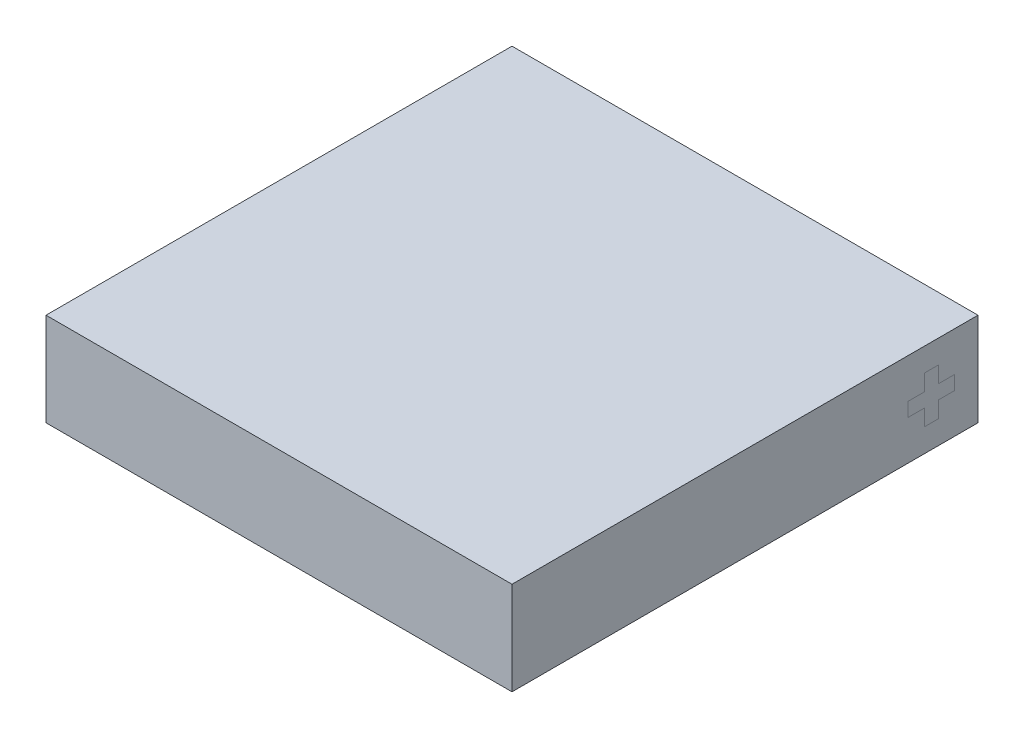
ISO-10303-21;
HEADER;
FILE_DESCRIPTION(('STEP AP214'),'2;1');
FILE_NAME('part.step','',(''),(''),'','','');
FILE_SCHEMA(('AUTOMOTIVE_DESIGN { 1 0 10303 214 1 1 1 1 }'));
ENDSEC;
DATA;
#1=APPLICATION_CONTEXT('core data for automotive mechanical design processes');
#2=APPLICATION_PROTOCOL_DEFINITION('international standard','automotive_design',2000,#1);
#3=PRODUCT_CONTEXT('',#1,'mechanical');
#4=PRODUCT('Part','Part','',(#3));
#5=PRODUCT_RELATED_PRODUCT_CATEGORY('part','',(#4));
#6=PRODUCT_DEFINITION_FORMATION('','',#4);
#7=PRODUCT_DEFINITION_CONTEXT('part definition',#1,'design');
#8=PRODUCT_DEFINITION('design','',#6,#7);
#9=PRODUCT_DEFINITION_SHAPE('','',#8);
#10=(LENGTH_UNIT() NAMED_UNIT(*) SI_UNIT(.MILLI.,.METRE.));
#11=(NAMED_UNIT(*) PLANE_ANGLE_UNIT() SI_UNIT($,.RADIAN.));
#12=(NAMED_UNIT(*) SI_UNIT($,.STERADIAN.) SOLID_ANGLE_UNIT());
#13=UNCERTAINTY_MEASURE_WITH_UNIT(LENGTH_MEASURE(1.E-05),#10,'distance_accuracy_value','');
#14=(GEOMETRIC_REPRESENTATION_CONTEXT(3) GLOBAL_UNCERTAINTY_ASSIGNED_CONTEXT((#13)) GLOBAL_UNIT_ASSIGNED_CONTEXT((#10,
#11,#12)) REPRESENTATION_CONTEXT('',''));
#15=CARTESIAN_POINT('',(0.,0.,0.));
#16=DIRECTION('',(0.,0.,1.));
#17=DIRECTION('',(1.,0.,0.));
#18=AXIS2_PLACEMENT_3D('',#15,#16,#17);
#19=CARTESIAN_POINT('',(5.,2.,-5.));
#20=DIRECTION('',(-1.,0.,0.));
#21=DIRECTION('',(0.,0.,1.));
#22=AXIS2_PLACEMENT_3D('',#19,#20,#21);
#23=PLANE('',#22);
#24=DIRECTION('',(0.,1.,0.));
#25=VECTOR('',#24,1.);
#26=CARTESIAN_POINT('',(5.,0.850000000000001,-4.15));
#27=LINE('',#26,#25);
#28=CARTESIAN_POINT('',(5.,0.500000000000001,-4.15));
#29=VERTEX_POINT('',#28);
#30=CARTESIAN_POINT('',(5.,0.850000000000001,-4.15));
#31=VERTEX_POINT('',#30);
#32=EDGE_CURVE('E445',#29,#31,#27,.T.);
#33=ORIENTED_EDGE('',*,*,#32,.T.);
#34=DIRECTION('',(0.,0.,-1.));
#35=VECTOR('',#34,1.);
#36=CARTESIAN_POINT('',(5.,0.850000000000001,-4.15));
#37=LINE('',#36,#35);
#38=CARTESIAN_POINT('',(5.,0.850000000000001,-4.5));
#39=VERTEX_POINT('',#38);
#40=EDGE_CURVE('E13',#31,#39,#37,.T.);
#41=ORIENTED_EDGE('',*,*,#40,.T.);
#42=DIRECTION('',(0.,1.,0.));
#43=VECTOR('',#42,1.);
#44=CARTESIAN_POINT('',(5.,1.15,-4.5));
#45=LINE('',#44,#43);
#46=CARTESIAN_POINT('',(5.,1.15,-4.5));
#47=VERTEX_POINT('',#46);
#48=EDGE_CURVE('E357',#39,#47,#45,.T.);
#49=ORIENTED_EDGE('',*,*,#48,.T.);
#50=DIRECTION('',(0.,0.,1.));
#51=VECTOR('',#50,1.);
#52=CARTESIAN_POINT('',(5.,1.15,-4.15));
#53=LINE('',#52,#51);
#54=CARTESIAN_POINT('',(5.,1.15,-4.15));
#55=VERTEX_POINT('',#54);
#56=EDGE_CURVE('E477',#47,#55,#53,.T.);
#57=ORIENTED_EDGE('',*,*,#56,.T.);
#58=DIRECTION('',(0.,1.,0.));
#59=VECTOR('',#58,1.);
#60=CARTESIAN_POINT('',(5.,1.5,-4.15));
#61=LINE('',#60,#59);
#62=CARTESIAN_POINT('',(5.,1.5,-4.15));
#63=VERTEX_POINT('',#62);
#64=EDGE_CURVE('E474',#55,#63,#61,.T.);
#65=ORIENTED_EDGE('',*,*,#64,.T.);
#66=DIRECTION('',(0.,0.,1.));
#67=VECTOR('',#66,1.);
#68=CARTESIAN_POINT('',(5.,1.5,-3.85));
#69=LINE('',#68,#67);
#70=CARTESIAN_POINT('',(5.,1.5,-3.85));
#71=VERTEX_POINT('',#70);
#72=EDGE_CURVE('E471',#63,#71,#69,.T.);
#73=ORIENTED_EDGE('',*,*,#72,.T.);
#74=DIRECTION('',(0.,-1.,0.));
#75=VECTOR('',#74,1.);
#76=CARTESIAN_POINT('',(5.,1.5,-3.85));
#77=LINE('',#76,#75);
#78=CARTESIAN_POINT('',(5.,1.15,-3.85));
#79=VERTEX_POINT('',#78);
#80=EDGE_CURVE('E468',#71,#79,#77,.T.);
#81=ORIENTED_EDGE('',*,*,#80,.T.);
#82=DIRECTION('',(0.,0.,1.));
#83=VECTOR('',#82,1.);
#84=CARTESIAN_POINT('',(5.,1.15,-3.5));
#85=LINE('',#84,#83);
#86=CARTESIAN_POINT('',(5.,1.15,-3.5));
#87=VERTEX_POINT('',#86);
#88=EDGE_CURVE('E465',#79,#87,#85,.T.);
#89=ORIENTED_EDGE('',*,*,#88,.T.);
#90=DIRECTION('',(0.,-1.,0.));
#91=VECTOR('',#90,1.);
#92=CARTESIAN_POINT('',(5.,1.15,-3.5));
#93=LINE('',#92,#91);
#94=CARTESIAN_POINT('',(5.,0.850000000000001,-3.5));
#95=VERTEX_POINT('',#94);
#96=EDGE_CURVE('E462',#87,#95,#93,.T.);
#97=ORIENTED_EDGE('',*,*,#96,.T.);
#98=DIRECTION('',(0.,0.,-1.));
#99=VECTOR('',#98,1.);
#100=CARTESIAN_POINT('',(5.,0.850000000000001,-3.5));
#101=LINE('',#100,#99);
#102=CARTESIAN_POINT('',(5.,0.850000000000001,-3.85));
#103=VERTEX_POINT('',#102);
#104=EDGE_CURVE('E459',#95,#103,#101,.T.);
#105=ORIENTED_EDGE('',*,*,#104,.T.);
#106=DIRECTION('',(0.,-1.,0.));
#107=VECTOR('',#106,1.);
#108=CARTESIAN_POINT('',(5.,0.850000000000001,-3.85));
#109=LINE('',#108,#107);
#110=CARTESIAN_POINT('',(5.,0.500000000000001,-3.85));
#111=VERTEX_POINT('',#110);
#112=EDGE_CURVE('E456',#103,#111,#109,.T.);
#113=ORIENTED_EDGE('',*,*,#112,.T.);
#114=DIRECTION('',(0.,0.,-1.));
#115=VECTOR('',#114,1.);
#116=CARTESIAN_POINT('',(5.,0.500000000000001,-3.85));
#117=LINE('',#116,#115);
#118=EDGE_CURVE('E448',#111,#29,#117,.T.);
#119=ORIENTED_EDGE('',*,*,#118,.T.);
#120=EDGE_LOOP('',(#33,#41,#49,#57,#65,#73,#81,#89,#97,#105,#113,#119));
#121=FACE_BOUND('',#120,.T.);
#122=ADVANCED_FACE('F348',(#121),#23,.F.);
#123=CARTESIAN_POINT('',(-5.,2.,-5.));
#124=DIRECTION('',(1.,0.,0.));
#125=DIRECTION('',(0.,0.,-1.));
#126=AXIS2_PLACEMENT_3D('',#123,#124,#125);
#127=PLANE('',#126);
#128=DIRECTION('',(0.,0.,1.));
#129=VECTOR('',#128,1.);
#130=CARTESIAN_POINT('',(-5.,0.,-5.));
#131=LINE('',#130,#129);
#132=CARTESIAN_POINT('',(-5.,0.,-5.));
#133=VERTEX_POINT('',#132);
#134=CARTESIAN_POINT('',(-5.,0.,5.));
#135=VERTEX_POINT('',#134);
#136=EDGE_CURVE('E444',#133,#135,#131,.T.);
#137=ORIENTED_EDGE('',*,*,#136,.T.);
#138=DIRECTION('',(0.,-1.,0.));
#139=VECTOR('',#138,1.);
#140=CARTESIAN_POINT('',(-5.,2.,5.));
#141=LINE('',#140,#139);
#142=CARTESIAN_POINT('',(-5.,2.,5.));
#143=VERTEX_POINT('',#142);
#144=EDGE_CURVE('E425',#143,#135,#141,.T.);
#145=ORIENTED_EDGE('',*,*,#144,.F.);
#146=DIRECTION('',(0.,0.,1.));
#147=VECTOR('',#146,1.);
#148=CARTESIAN_POINT('',(-5.,2.,-5.));
#149=LINE('',#148,#147);
#150=CARTESIAN_POINT('',(-5.,2.,-5.));
#151=VERTEX_POINT('',#150);
#152=EDGE_CURVE('E432',#151,#143,#149,.T.);
#153=ORIENTED_EDGE('',*,*,#152,.F.);
#154=DIRECTION('',(0.,-1.,0.));
#155=VECTOR('',#154,1.);
#156=CARTESIAN_POINT('',(-5.,2.,-5.));
#157=LINE('',#156,#155);
#158=EDGE_CURVE('E528',#151,#133,#157,.T.);
#159=ORIENTED_EDGE('',*,*,#158,.T.);
#160=EDGE_LOOP('',(#137,#145,#153,#159));
#161=FACE_BOUND('',#160,.T.);
#162=ADVANCED_FACE('F350',(#161),#127,.F.);
#163=CARTESIAN_POINT('',(-5.,2.,5.));
#164=DIRECTION('',(0.,0.,-1.));
#165=DIRECTION('',(-1.,0.,0.));
#166=AXIS2_PLACEMENT_3D('',#163,#164,#165);
#167=PLANE('',#166);
#168=DIRECTION('',(1.,0.,0.));
#169=VECTOR('',#168,1.);
#170=CARTESIAN_POINT('',(-5.,0.,5.));
#171=LINE('',#170,#169);
#172=CARTESIAN_POINT('',(5.,0.,5.));
#173=VERTEX_POINT('',#172);
#174=EDGE_CURVE('E525',#135,#173,#171,.T.);
#175=ORIENTED_EDGE('',*,*,#174,.T.);
#176=DIRECTION('',(0.,-1.,0.));
#177=VECTOR('',#176,1.);
#178=CARTESIAN_POINT('',(5.,2.,5.));
#179=LINE('',#178,#177);
#180=CARTESIAN_POINT('',(5.,2.,5.));
#181=VERTEX_POINT('',#180);
#182=EDGE_CURVE('E428',#181,#173,#179,.T.);
#183=ORIENTED_EDGE('',*,*,#182,.F.);
#184=DIRECTION('',(1.,0.,0.));
#185=VECTOR('',#184,1.);
#186=CARTESIAN_POINT('',(-5.,2.,5.));
#187=LINE('',#186,#185);
#188=EDGE_CURVE('E421',#143,#181,#187,.T.);
#189=ORIENTED_EDGE('',*,*,#188,.F.);
#190=ORIENTED_EDGE('',*,*,#144,.T.);
#191=EDGE_LOOP('',(#175,#183,#189,#190));
#192=FACE_BOUND('',#191,.T.);
#193=ADVANCED_FACE('F423',(#192),#167,.F.);
#194=ORIENTED_EDGE('',*,*,#40,.F.);
#195=ORIENTED_EDGE('',*,*,#32,.F.);
#196=ORIENTED_EDGE('',*,*,#118,.F.);
#197=ORIENTED_EDGE('',*,*,#112,.F.);
#198=ORIENTED_EDGE('',*,*,#104,.F.);
#199=ORIENTED_EDGE('',*,*,#96,.F.);
#200=ORIENTED_EDGE('',*,*,#88,.F.);
#201=ORIENTED_EDGE('',*,*,#80,.F.);
#202=ORIENTED_EDGE('',*,*,#72,.F.);
#203=ORIENTED_EDGE('',*,*,#64,.F.);
#204=ORIENTED_EDGE('',*,*,#56,.F.);
#205=ORIENTED_EDGE('',*,*,#48,.F.);
#206=EDGE_LOOP('',(#194,#195,#196,#197,#198,#199,#200,#201,#202,#203,#204,#205));
#207=FACE_BOUND('',#206,.T.);
#208=DIRECTION('',(0.,0.,-1.));
#209=VECTOR('',#208,1.);
#210=CARTESIAN_POINT('',(5.,0.,-5.));
#211=LINE('',#210,#209);
#212=CARTESIAN_POINT('',(5.,0.,-5.));
#213=VERTEX_POINT('',#212);
#214=EDGE_CURVE('E521',#173,#213,#211,.T.);
#215=ORIENTED_EDGE('',*,*,#214,.T.);
#216=DIRECTION('',(0.,-1.,0.));
#217=VECTOR('',#216,1.);
#218=CARTESIAN_POINT('',(5.,2.,-5.));
#219=LINE('',#218,#217);
#220=CARTESIAN_POINT('',(5.,2.,-5.));
#221=VERTEX_POINT('',#220);
#222=EDGE_CURVE('E450',#221,#213,#219,.T.);
#223=ORIENTED_EDGE('',*,*,#222,.F.);
#224=DIRECTION('',(0.,0.,-1.));
#225=VECTOR('',#224,1.);
#226=CARTESIAN_POINT('',(5.,2.,-5.));
#227=LINE('',#226,#225);
#228=EDGE_CURVE('E431',#181,#221,#227,.T.);
#229=ORIENTED_EDGE('',*,*,#228,.F.);
#230=ORIENTED_EDGE('',*,*,#182,.T.);
#231=EDGE_LOOP('',(#215,#223,#229,#230));
#232=FACE_BOUND('',#231,.T.);
#233=ADVANCED_FACE('F507',(#207,#232),#23,.F.);
#234=CARTESIAN_POINT('',(-5.,2.,-5.));
#235=DIRECTION('',(0.,0.,1.));
#236=DIRECTION('',(1.,0.,0.));
#237=AXIS2_PLACEMENT_3D('',#234,#235,#236);
#238=PLANE('',#237);
#239=DIRECTION('',(-1.,0.,0.));
#240=VECTOR('',#239,1.);
#241=CARTESIAN_POINT('',(-5.,0.,-5.));
#242=LINE('',#241,#240);
#243=EDGE_CURVE('E441',#213,#133,#242,.T.);
#244=ORIENTED_EDGE('',*,*,#243,.T.);
#245=ORIENTED_EDGE('',*,*,#158,.F.);
#246=DIRECTION('',(-1.,0.,0.));
#247=VECTOR('',#246,1.);
#248=CARTESIAN_POINT('',(-5.,2.,-5.));
#249=LINE('',#248,#247);
#250=EDGE_CURVE('E437',#221,#151,#249,.T.);
#251=ORIENTED_EDGE('',*,*,#250,.F.);
#252=ORIENTED_EDGE('',*,*,#222,.T.);
#253=EDGE_LOOP('',(#244,#245,#251,#252));
#254=FACE_BOUND('',#253,.T.);
#255=ADVANCED_FACE('F517',(#254),#238,.F.);
#256=CARTESIAN_POINT('',(0.,2.,0.));
#257=DIRECTION('',(0.,1.,0.));
#258=DIRECTION('',(0.,0.,1.));
#259=AXIS2_PLACEMENT_3D('',#256,#257,#258);
#260=PLANE('',#259);
#261=ORIENTED_EDGE('',*,*,#152,.T.);
#262=ORIENTED_EDGE('',*,*,#188,.T.);
#263=ORIENTED_EDGE('',*,*,#228,.T.);
#264=ORIENTED_EDGE('',*,*,#250,.T.);
#265=EDGE_LOOP('',(#261,#262,#263,#264));
#266=FACE_BOUND('',#265,.T.);
#267=ADVANCED_FACE('F435',(#266),#260,.T.);
#268=CARTESIAN_POINT('',(0.,0.,0.));
#269=DIRECTION('',(0.,1.,0.));
#270=DIRECTION('',(0.,0.,1.));
#271=AXIS2_PLACEMENT_3D('',#268,#269,#270);
#272=PLANE('',#271);
#273=ORIENTED_EDGE('',*,*,#136,.F.);
#274=ORIENTED_EDGE('',*,*,#243,.F.);
#275=ORIENTED_EDGE('',*,*,#214,.F.);
#276=ORIENTED_EDGE('',*,*,#174,.F.);
#277=EDGE_LOOP('',(#273,#274,#275,#276));
#278=FACE_BOUND('',#277,.T.);
#279=ADVANCED_FACE('F529',(#278),#272,.F.);
#280=CLOSED_SHELL('',(#122,#162,#193,#233,#255,#267,#279));
#281=MANIFOLD_SOLID_BREP('B2',#280);
#282=ADVANCED_BREP_SHAPE_REPRESENTATION('',(#18,#281),#14);
#283=SHAPE_DEFINITION_REPRESENTATION(#9,#282);
ENDSEC;
END-ISO-10303-21;
